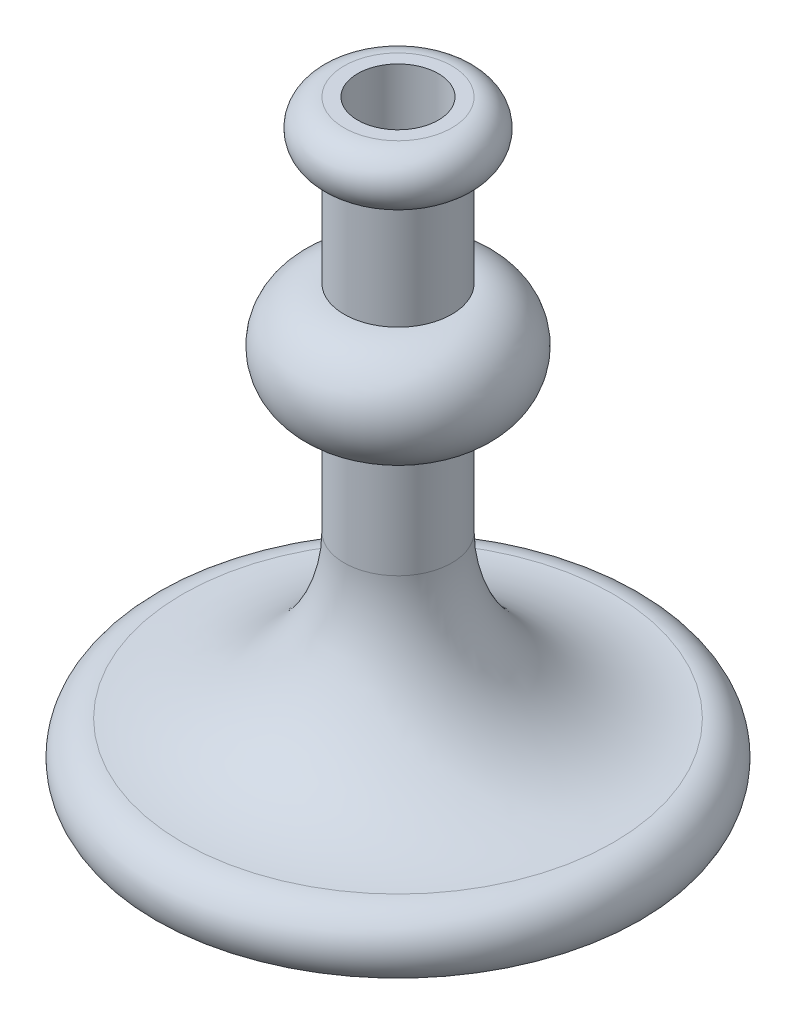
ISO-10303-21;
HEADER;
FILE_DESCRIPTION(('STEP AP214'),'2;1');
FILE_NAME('part.step','',(''),(''),'','','');
FILE_SCHEMA(('AUTOMOTIVE_DESIGN { 1 0 10303 214 1 1 1 1 }'));
ENDSEC;
DATA;
#1=APPLICATION_CONTEXT('core data for automotive mechanical design processes');
#2=APPLICATION_PROTOCOL_DEFINITION('international standard','automotive_design',2000,#1);
#3=PRODUCT_CONTEXT('',#1,'mechanical');
#4=PRODUCT('Part','Part','',(#3));
#5=PRODUCT_RELATED_PRODUCT_CATEGORY('part','',(#4));
#6=PRODUCT_DEFINITION_FORMATION('','',#4);
#7=PRODUCT_DEFINITION_CONTEXT('part definition',#1,'design');
#8=PRODUCT_DEFINITION('design','',#6,#7);
#9=PRODUCT_DEFINITION_SHAPE('','',#8);
#10=(LENGTH_UNIT() NAMED_UNIT(*) SI_UNIT(.MILLI.,.METRE.));
#11=(NAMED_UNIT(*) PLANE_ANGLE_UNIT() SI_UNIT($,.RADIAN.));
#12=(NAMED_UNIT(*) SI_UNIT($,.STERADIAN.) SOLID_ANGLE_UNIT());
#13=UNCERTAINTY_MEASURE_WITH_UNIT(LENGTH_MEASURE(1.E-05),#10,'distance_accuracy_value','');
#14=(GEOMETRIC_REPRESENTATION_CONTEXT(3) GLOBAL_UNCERTAINTY_ASSIGNED_CONTEXT((#13)) GLOBAL_UNIT_ASSIGNED_CONTEXT((#10,
#11,#12)) REPRESENTATION_CONTEXT('',''));
#15=CARTESIAN_POINT('',(0.,0.,0.));
#16=DIRECTION('',(0.,0.,1.));
#17=DIRECTION('',(1.,0.,0.));
#18=AXIS2_PLACEMENT_3D('',#15,#16,#17);
#19=CARTESIAN_POINT('',(0.,5588.,0.));
#20=DIRECTION('',(0.,1.,0.));
#21=DIRECTION('',(0.,0.,1.));
#22=AXIS2_PLACEMENT_3D('',#19,#20,#21);
#23=PLANE('',#22);
#24=CARTESIAN_POINT('',(0.,5588.,0.));
#25=DIRECTION('',(0.,1.,0.));
#26=DIRECTION('',(0.,0.,1.));
#27=AXIS2_PLACEMENT_3D('',#24,#25,#26);
#28=CIRCLE('',#27,381.);
#29=CARTESIAN_POINT('',(0.,5588.,381.));
#30=VERTEX_POINT('',#29);
#31=EDGE_CURVE('E64',#30,#30,#28,.T.);
#32=ORIENTED_EDGE('',*,*,#31,.F.);
#33=EDGE_LOOP('',(#32));
#34=FACE_BOUND('',#33,.T.);
#35=CARTESIAN_POINT('',(0.,5588.,0.));
#36=DIRECTION('',(0.,-1.,0.));
#37=DIRECTION('',(0.,0.,-1.));
#38=AXIS2_PLACEMENT_3D('',#35,#36,#37);
#39=CIRCLE('',#38,508.);
#40=CARTESIAN_POINT('',(0.,5588.,-508.));
#41=VERTEX_POINT('',#40);
#42=EDGE_CURVE('E10',#41,#41,#39,.T.);
#43=ORIENTED_EDGE('',*,*,#42,.F.);
#44=EDGE_LOOP('',(#43));
#45=FACE_BOUND('',#44,.T.);
#46=ADVANCED_FACE('F35',(#34,#45),#23,.T.);
#47=CARTESIAN_POINT('',(0.,5334.,0.));
#48=DIRECTION('',(0.,-1.,0.));
#49=DIRECTION('',(0.,0.,-1.));
#50=AXIS2_PLACEMENT_3D('',#47,#48,#49);
#51=TOROIDAL_SURFACE('',#50,508.,254.);
#52=ORIENTED_EDGE('',*,*,#42,.T.);
#53=EDGE_LOOP('',(#52));
#54=FACE_BOUND('',#53,.T.);
#55=CARTESIAN_POINT('',(0.,5080.,0.));
#56=DIRECTION('',(0.,-1.,0.));
#57=DIRECTION('',(0.,0.,-1.));
#58=AXIS2_PLACEMENT_3D('',#55,#56,#57);
#59=CIRCLE('',#58,507.999999999996);
#60=CARTESIAN_POINT('',(0.,5080.,-507.999999999996));
#61=VERTEX_POINT('',#60);
#62=EDGE_CURVE('E41',#61,#61,#59,.T.);
#63=ORIENTED_EDGE('',*,*,#62,.F.);
#64=EDGE_LOOP('',(#63));
#65=FACE_BOUND('',#64,.T.);
#66=ADVANCED_FACE('F81',(#54,#65),#51,.T.);
#67=CARTESIAN_POINT('',(0.,0.,0.));
#68=DIRECTION('',(0.,-1.,0.));
#69=DIRECTION('',(0.,0.,-1.));
#70=AXIS2_PLACEMENT_3D('',#67,#68,#69);
#71=CYLINDRICAL_SURFACE('',#70,508.);
#72=ORIENTED_EDGE('',*,*,#62,.T.);
#73=EDGE_LOOP('',(#72));
#74=FACE_BOUND('',#73,.T.);
#75=CARTESIAN_POINT('',(0.,4064.,0.));
#76=DIRECTION('',(0.,-1.,0.));
#77=DIRECTION('',(0.,0.,-1.));
#78=AXIS2_PLACEMENT_3D('',#75,#76,#77);
#79=CIRCLE('',#78,508.000000000004);
#80=CARTESIAN_POINT('',(0.,4064.,-508.000000000004));
#81=VERTEX_POINT('',#80);
#82=EDGE_CURVE('E45',#81,#81,#79,.T.);
#83=ORIENTED_EDGE('',*,*,#82,.F.);
#84=EDGE_LOOP('',(#83));
#85=FACE_BOUND('',#84,.T.);
#86=ADVANCED_FACE('F85',(#74,#85),#71,.T.);
#87=CARTESIAN_POINT('',(0.,3556.,0.));
#88=DIRECTION('',(0.,-1.,0.));
#89=DIRECTION('',(0.,0.,-1.));
#90=AXIS2_PLACEMENT_3D('',#87,#88,#89);
#91=TOROIDAL_SURFACE('',#90,508.000000000004,508.);
#92=ORIENTED_EDGE('',*,*,#82,.T.);
#93=EDGE_LOOP('',(#92));
#94=FACE_BOUND('',#93,.T.);
#95=CARTESIAN_POINT('',(0.,3048.,0.));
#96=DIRECTION('',(0.,-1.,0.));
#97=DIRECTION('',(0.,0.,-1.));
#98=AXIS2_PLACEMENT_3D('',#95,#96,#97);
#99=CIRCLE('',#98,508.000000000004);
#100=CARTESIAN_POINT('',(0.,3048.,-508.000000000004));
#101=VERTEX_POINT('',#100);
#102=EDGE_CURVE('E49',#101,#101,#99,.T.);
#103=ORIENTED_EDGE('',*,*,#102,.F.);
#104=EDGE_LOOP('',(#103));
#105=FACE_BOUND('',#104,.T.);
#106=ADVANCED_FACE('F89',(#94,#105),#91,.T.);
#107=CARTESIAN_POINT('',(0.,0.,0.));
#108=DIRECTION('',(0.,-1.,0.));
#109=DIRECTION('',(0.,0.,-1.));
#110=AXIS2_PLACEMENT_3D('',#107,#108,#109);
#111=CYLINDRICAL_SURFACE('',#110,508.000000000004);
#112=ORIENTED_EDGE('',*,*,#102,.T.);
#113=EDGE_LOOP('',(#112));
#114=FACE_BOUND('',#113,.T.);
#115=CARTESIAN_POINT('',(0.,2032.,0.));
#116=DIRECTION('',(0.,-1.,0.));
#117=DIRECTION('',(0.,0.,-1.));
#118=AXIS2_PLACEMENT_3D('',#115,#116,#117);
#119=CIRCLE('',#118,508.000000000004);
#120=CARTESIAN_POINT('',(0.,2032.,-508.000000000004));
#121=VERTEX_POINT('',#120);
#122=EDGE_CURVE('E54',#121,#121,#119,.T.);
#123=ORIENTED_EDGE('',*,*,#122,.F.);
#124=EDGE_LOOP('',(#123));
#125=FACE_BOUND('',#124,.T.);
#126=ADVANCED_FACE('F95',(#114,#125),#111,.T.);
#127=CARTESIAN_POINT('',(0.,2032.,0.));
#128=DIRECTION('',(0.,-1.,0.));
#129=DIRECTION('',(0.,0.,-1.));
#130=AXIS2_PLACEMENT_3D('',#127,#128,#129);
#131=TOROIDAL_SURFACE('',#130,2032.,1524.);
#132=ORIENTED_EDGE('',*,*,#122,.T.);
#133=EDGE_LOOP('',(#132));
#134=FACE_BOUND('',#133,.T.);
#135=CARTESIAN_POINT('',(0.,508.000000000002,0.));
#136=DIRECTION('',(0.,-1.,0.));
#137=DIRECTION('',(0.,0.,-1.));
#138=AXIS2_PLACEMENT_3D('',#135,#136,#137);
#139=CIRCLE('',#138,2032.);
#140=CARTESIAN_POINT('',(0.,508.000000000002,-2032.));
#141=VERTEX_POINT('',#140);
#142=EDGE_CURVE('E57',#141,#141,#139,.T.);
#143=ORIENTED_EDGE('',*,*,#142,.F.);
#144=EDGE_LOOP('',(#143));
#145=FACE_BOUND('',#144,.T.);
#146=ADVANCED_FACE('F99',(#134,#145),#131,.F.);
#147=CARTESIAN_POINT('',(0.,190.500000000003,0.));
#148=DIRECTION('',(0.,-1.,0.));
#149=DIRECTION('',(0.,0.,-1.));
#150=AXIS2_PLACEMENT_3D('',#147,#148,#149);
#151=TOROIDAL_SURFACE('',#150,2032.,317.5);
#152=ORIENTED_EDGE('',*,*,#142,.T.);
#153=EDGE_LOOP('',(#152));
#154=FACE_BOUND('',#153,.T.);
#155=CARTESIAN_POINT('',(0.,0.,0.));
#156=DIRECTION('',(0.,-1.,0.));
#157=DIRECTION('',(0.,0.,-1.));
#158=AXIS2_PLACEMENT_3D('',#155,#156,#157);
#159=CIRCLE('',#158,2286.);
#160=CARTESIAN_POINT('',(0.,0.,-2286.));
#161=VERTEX_POINT('',#160);
#162=EDGE_CURVE('E60',#161,#161,#159,.T.);
#163=ORIENTED_EDGE('',*,*,#162,.F.);
#164=EDGE_LOOP('',(#163));
#165=FACE_BOUND('',#164,.T.);
#166=ADVANCED_FACE('F103',(#154,#165),#151,.T.);
#167=CARTESIAN_POINT('',(0.,0.,0.));
#168=DIRECTION('',(0.,-1.,0.));
#169=DIRECTION('',(0.,0.,-1.));
#170=AXIS2_PLACEMENT_3D('',#167,#168,#169);
#171=PLANE('',#170);
#172=CARTESIAN_POINT('',(0.,0.,0.));
#173=DIRECTION('',(0.,1.,0.));
#174=DIRECTION('',(0.,0.,1.));
#175=AXIS2_PLACEMENT_3D('',#172,#173,#174);
#176=CIRCLE('',#175,381.);
#177=CARTESIAN_POINT('',(0.,0.,381.));
#178=VERTEX_POINT('',#177);
#179=EDGE_CURVE('E63',#178,#178,#176,.T.);
#180=ORIENTED_EDGE('',*,*,#179,.T.);
#181=EDGE_LOOP('',(#180));
#182=FACE_BOUND('',#181,.T.);
#183=ORIENTED_EDGE('',*,*,#162,.T.);
#184=EDGE_LOOP('',(#183));
#185=FACE_BOUND('',#184,.T.);
#186=ADVANCED_FACE('F70',(#182,#185),#171,.T.);
#187=CARTESIAN_POINT('',(0.,0.,0.));
#188=DIRECTION('',(0.,1.,0.));
#189=DIRECTION('',(0.,0.,1.));
#190=AXIS2_PLACEMENT_3D('',#187,#188,#189);
#191=CYLINDRICAL_SURFACE('',#190,381.);
#192=ORIENTED_EDGE('',*,*,#179,.F.);
#193=EDGE_LOOP('',(#192));
#194=FACE_BOUND('',#193,.T.);
#195=ORIENTED_EDGE('',*,*,#31,.T.);
#196=EDGE_LOOP('',(#195));
#197=FACE_BOUND('',#196,.T.);
#198=ADVANCED_FACE('F73',(#194,#197),#191,.F.);
#199=CLOSED_SHELL('',(#46,#66,#86,#106,#126,#146,#166,#186,#198));
#200=MANIFOLD_SOLID_BREP('B2',#199);
#201=ADVANCED_BREP_SHAPE_REPRESENTATION('',(#18,#200),#14);
#202=SHAPE_DEFINITION_REPRESENTATION(#9,#201);
ENDSEC;
END-ISO-10303-21;
